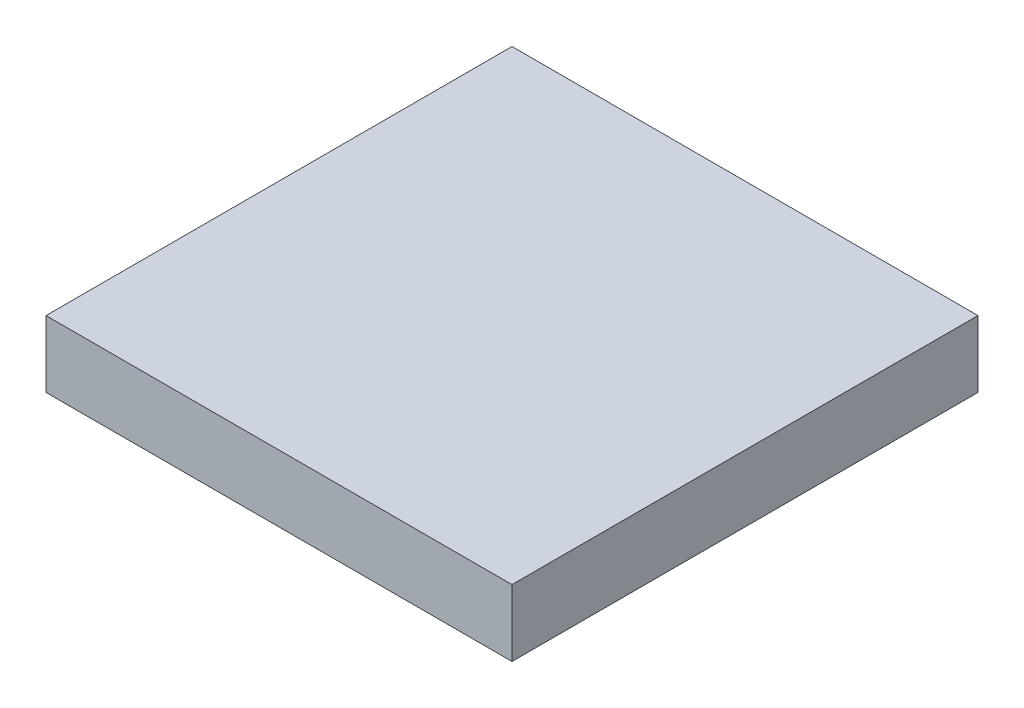
ISO-10303-21;
HEADER;
FILE_DESCRIPTION(('STEP AP214'),'2;1');
FILE_NAME('part.step','',(''),(''),'','','');
FILE_SCHEMA(('AUTOMOTIVE_DESIGN { 1 0 10303 214 1 1 1 1 }'));
ENDSEC;
DATA;
#1=APPLICATION_CONTEXT('core data for automotive mechanical design processes');
#2=APPLICATION_PROTOCOL_DEFINITION('international standard','automotive_design',2000,#1);
#3=PRODUCT_CONTEXT('',#1,'mechanical');
#4=PRODUCT('Part','Part','',(#3));
#5=PRODUCT_RELATED_PRODUCT_CATEGORY('part','',(#4));
#6=PRODUCT_DEFINITION_FORMATION('','',#4);
#7=PRODUCT_DEFINITION_CONTEXT('part definition',#1,'design');
#8=PRODUCT_DEFINITION('design','',#6,#7);
#9=PRODUCT_DEFINITION_SHAPE('','',#8);
#10=(LENGTH_UNIT() NAMED_UNIT(*) SI_UNIT(.MILLI.,.METRE.));
#11=(NAMED_UNIT(*) PLANE_ANGLE_UNIT() SI_UNIT($,.RADIAN.));
#12=(NAMED_UNIT(*) SI_UNIT($,.STERADIAN.) SOLID_ANGLE_UNIT());
#13=UNCERTAINTY_MEASURE_WITH_UNIT(LENGTH_MEASURE(1.E-05),#10,'distance_accuracy_value','');
#14=(GEOMETRIC_REPRESENTATION_CONTEXT(3) GLOBAL_UNCERTAINTY_ASSIGNED_CONTEXT((#13)) GLOBAL_UNIT_ASSIGNED_CONTEXT((#10,
#11,#12)) REPRESENTATION_CONTEXT('',''));
#15=CARTESIAN_POINT('',(0.,0.,0.));
#16=DIRECTION('',(0.,0.,1.));
#17=DIRECTION('',(1.,0.,0.));
#18=AXIS2_PLACEMENT_3D('',#15,#16,#17);
#19=CARTESIAN_POINT('',(7.,2.,-7.));
#20=DIRECTION('',(-1.,0.,0.));
#21=DIRECTION('',(0.,0.,1.));
#22=AXIS2_PLACEMENT_3D('',#19,#20,#21);
#23=PLANE('',#22);
#24=DIRECTION('',(0.,0.,-1.));
#25=VECTOR('',#24,1.);
#26=CARTESIAN_POINT('',(7.,0.,-7.));
#27=LINE('',#26,#25);
#28=CARTESIAN_POINT('',(7.,0.,7.));
#29=VERTEX_POINT('',#28);
#30=CARTESIAN_POINT('',(7.,0.,-7.));
#31=VERTEX_POINT('',#30);
#32=EDGE_CURVE('E98',#29,#31,#27,.T.);
#33=ORIENTED_EDGE('',*,*,#32,.T.);
#34=DIRECTION('',(0.,-1.,0.));
#35=VECTOR('',#34,1.);
#36=CARTESIAN_POINT('',(7.,2.,-7.));
#37=LINE('',#36,#35);
#38=CARTESIAN_POINT('',(7.,2.,-7.));
#39=VERTEX_POINT('',#38);
#40=EDGE_CURVE('E11',#39,#31,#37,.T.);
#41=ORIENTED_EDGE('',*,*,#40,.F.);
#42=DIRECTION('',(0.,0.,-1.));
#43=VECTOR('',#42,1.);
#44=CARTESIAN_POINT('',(7.,2.,-7.));
#45=LINE('',#44,#43);
#46=CARTESIAN_POINT('',(7.,2.,7.));
#47=VERTEX_POINT('',#46);
#48=EDGE_CURVE('E86',#47,#39,#45,.T.);
#49=ORIENTED_EDGE('',*,*,#48,.F.);
#50=DIRECTION('',(0.,-1.,0.));
#51=VECTOR('',#50,1.);
#52=CARTESIAN_POINT('',(7.,2.,7.));
#53=LINE('',#52,#51);
#54=EDGE_CURVE('E94',#47,#29,#53,.T.);
#55=ORIENTED_EDGE('',*,*,#54,.T.);
#56=EDGE_LOOP('',(#33,#41,#49,#55));
#57=FACE_BOUND('',#56,.T.);
#58=ADVANCED_FACE('F35',(#57),#23,.F.);
#59=CARTESIAN_POINT('',(-7.,2.,-7.));
#60=DIRECTION('',(0.,0.,1.));
#61=DIRECTION('',(1.,0.,0.));
#62=AXIS2_PLACEMENT_3D('',#59,#60,#61);
#63=PLANE('',#62);
#64=DIRECTION('',(-1.,0.,0.));
#65=VECTOR('',#64,1.);
#66=CARTESIAN_POINT('',(-7.,0.,-7.));
#67=LINE('',#66,#65);
#68=CARTESIAN_POINT('',(-7.,0.,-7.));
#69=VERTEX_POINT('',#68);
#70=EDGE_CURVE('E90',#31,#69,#67,.T.);
#71=ORIENTED_EDGE('',*,*,#70,.T.);
#72=DIRECTION('',(0.,-1.,0.));
#73=VECTOR('',#72,1.);
#74=CARTESIAN_POINT('',(-7.,2.,-7.));
#75=LINE('',#74,#73);
#76=CARTESIAN_POINT('',(-7.,2.,-7.));
#77=VERTEX_POINT('',#76);
#78=EDGE_CURVE('E43',#77,#69,#75,.T.);
#79=ORIENTED_EDGE('',*,*,#78,.F.);
#80=DIRECTION('',(-1.,0.,0.));
#81=VECTOR('',#80,1.);
#82=CARTESIAN_POINT('',(-7.,2.,-7.));
#83=LINE('',#82,#81);
#84=EDGE_CURVE('E81',#39,#77,#83,.T.);
#85=ORIENTED_EDGE('',*,*,#84,.F.);
#86=ORIENTED_EDGE('',*,*,#40,.T.);
#87=EDGE_LOOP('',(#71,#79,#85,#86));
#88=FACE_BOUND('',#87,.T.);
#89=ADVANCED_FACE('F89',(#88),#63,.F.);
#90=CARTESIAN_POINT('',(-7.,2.,-7.));
#91=DIRECTION('',(1.,0.,0.));
#92=DIRECTION('',(0.,0.,-1.));
#93=AXIS2_PLACEMENT_3D('',#90,#91,#92);
#94=PLANE('',#93);
#95=DIRECTION('',(0.,0.,1.));
#96=VECTOR('',#95,1.);
#97=CARTESIAN_POINT('',(-7.,0.,-7.));
#98=LINE('',#97,#96);
#99=CARTESIAN_POINT('',(-7.,0.,7.));
#100=VERTEX_POINT('',#99);
#101=EDGE_CURVE('E68',#69,#100,#98,.T.);
#102=ORIENTED_EDGE('',*,*,#101,.T.);
#103=DIRECTION('',(0.,-1.,0.));
#104=VECTOR('',#103,1.);
#105=CARTESIAN_POINT('',(-7.,2.,7.));
#106=LINE('',#105,#104);
#107=CARTESIAN_POINT('',(-7.,2.,7.));
#108=VERTEX_POINT('',#107);
#109=EDGE_CURVE('E91',#108,#100,#106,.T.);
#110=ORIENTED_EDGE('',*,*,#109,.F.);
#111=DIRECTION('',(0.,0.,1.));
#112=VECTOR('',#111,1.);
#113=CARTESIAN_POINT('',(-7.,2.,-7.));
#114=LINE('',#113,#112);
#115=EDGE_CURVE('E84',#77,#108,#114,.T.);
#116=ORIENTED_EDGE('',*,*,#115,.F.);
#117=ORIENTED_EDGE('',*,*,#78,.T.);
#118=EDGE_LOOP('',(#102,#110,#116,#117));
#119=FACE_BOUND('',#118,.T.);
#120=ADVANCED_FACE('F92',(#119),#94,.F.);
#121=CARTESIAN_POINT('',(-7.,2.,7.));
#122=DIRECTION('',(0.,0.,-1.));
#123=DIRECTION('',(-1.,0.,0.));
#124=AXIS2_PLACEMENT_3D('',#121,#122,#123);
#125=PLANE('',#124);
#126=DIRECTION('',(1.,0.,0.));
#127=VECTOR('',#126,1.);
#128=CARTESIAN_POINT('',(-7.,0.,7.));
#129=LINE('',#128,#127);
#130=EDGE_CURVE('E74',#100,#29,#129,.T.);
#131=ORIENTED_EDGE('',*,*,#130,.T.);
#132=ORIENTED_EDGE('',*,*,#54,.F.);
#133=DIRECTION('',(1.,0.,0.));
#134=VECTOR('',#133,1.);
#135=CARTESIAN_POINT('',(-7.,2.,7.));
#136=LINE('',#135,#134);
#137=EDGE_CURVE('E51',#108,#47,#136,.T.);
#138=ORIENTED_EDGE('',*,*,#137,.F.);
#139=ORIENTED_EDGE('',*,*,#109,.T.);
#140=EDGE_LOOP('',(#131,#132,#138,#139));
#141=FACE_BOUND('',#140,.T.);
#142=ADVANCED_FACE('F105',(#141),#125,.F.);
#143=CARTESIAN_POINT('',(0.,2.,0.));
#144=DIRECTION('',(0.,1.,0.));
#145=DIRECTION('',(0.,0.,1.));
#146=AXIS2_PLACEMENT_3D('',#143,#144,#145);
#147=PLANE('',#146);
#148=ORIENTED_EDGE('',*,*,#48,.T.);
#149=ORIENTED_EDGE('',*,*,#84,.T.);
#150=ORIENTED_EDGE('',*,*,#115,.T.);
#151=ORIENTED_EDGE('',*,*,#137,.T.);
#152=EDGE_LOOP('',(#148,#149,#150,#151));
#153=FACE_BOUND('',#152,.T.);
#154=ADVANCED_FACE('F82',(#153),#147,.T.);
#155=CARTESIAN_POINT('',(0.,0.,0.));
#156=DIRECTION('',(0.,1.,0.));
#157=DIRECTION('',(0.,0.,1.));
#158=AXIS2_PLACEMENT_3D('',#155,#156,#157);
#159=PLANE('',#158);
#160=ORIENTED_EDGE('',*,*,#32,.F.);
#161=ORIENTED_EDGE('',*,*,#130,.F.);
#162=ORIENTED_EDGE('',*,*,#101,.F.);
#163=ORIENTED_EDGE('',*,*,#70,.F.);
#164=EDGE_LOOP('',(#160,#161,#162,#163));
#165=FACE_BOUND('',#164,.T.);
#166=ADVANCED_FACE('F108',(#165),#159,.F.);
#167=CLOSED_SHELL('',(#58,#89,#120,#142,#154,#166));
#168=MANIFOLD_SOLID_BREP('B2',#167);
#169=ADVANCED_BREP_SHAPE_REPRESENTATION('',(#18,#168),#14);
#170=SHAPE_DEFINITION_REPRESENTATION(#9,#169);
ENDSEC;
END-ISO-10303-21;
